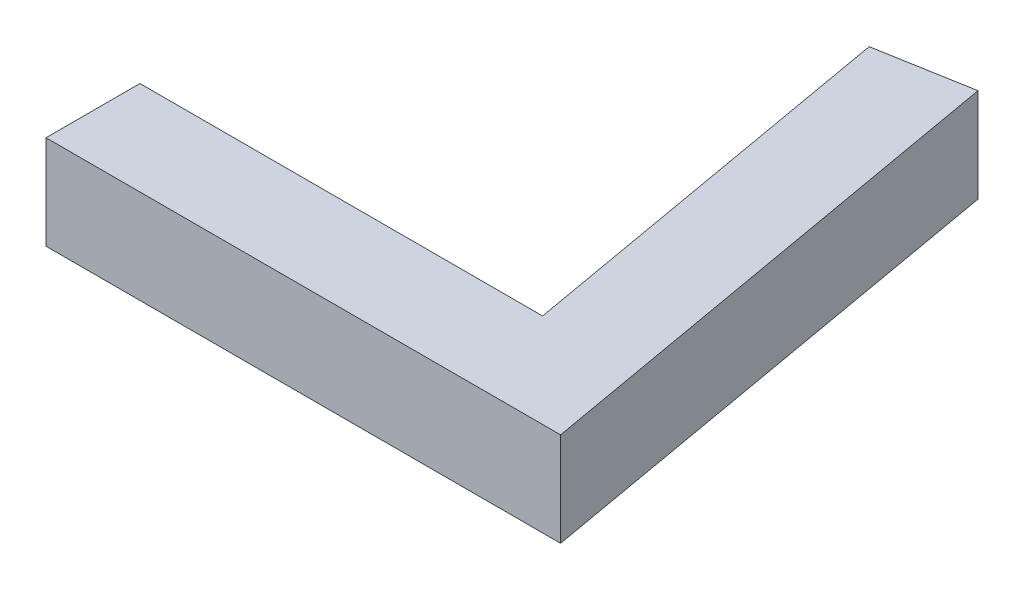
ISO-10303-21;
HEADER;
FILE_DESCRIPTION(('STEP AP214'),'2;1');
FILE_NAME('part.step','',(''),(''),'','','');
FILE_SCHEMA(('AUTOMOTIVE_DESIGN { 1 0 10303 214 1 1 1 1 }'));
ENDSEC;
DATA;
#1=APPLICATION_CONTEXT('core data for automotive mechanical design processes');
#2=APPLICATION_PROTOCOL_DEFINITION('international standard','automotive_design',2000,#1);
#3=PRODUCT_CONTEXT('',#1,'mechanical');
#4=PRODUCT('Part','Part','',(#3));
#5=PRODUCT_RELATED_PRODUCT_CATEGORY('part','',(#4));
#6=PRODUCT_DEFINITION_FORMATION('','',#4);
#7=PRODUCT_DEFINITION_CONTEXT('part definition',#1,'design');
#8=PRODUCT_DEFINITION('design','',#6,#7);
#9=PRODUCT_DEFINITION_SHAPE('','',#8);
#10=(LENGTH_UNIT() NAMED_UNIT(*) SI_UNIT(.MILLI.,.METRE.));
#11=(NAMED_UNIT(*) PLANE_ANGLE_UNIT() SI_UNIT($,.RADIAN.));
#12=(NAMED_UNIT(*) SI_UNIT($,.STERADIAN.) SOLID_ANGLE_UNIT());
#13=UNCERTAINTY_MEASURE_WITH_UNIT(LENGTH_MEASURE(1.E-05),#10,'distance_accuracy_value','');
#14=(GEOMETRIC_REPRESENTATION_CONTEXT(3) GLOBAL_UNCERTAINTY_ASSIGNED_CONTEXT((#13)) GLOBAL_UNIT_ASSIGNED_CONTEXT((#10,
#11,#12)) REPRESENTATION_CONTEXT('',''));
#15=CARTESIAN_POINT('',(0.,0.,0.));
#16=DIRECTION('',(0.,0.,1.));
#17=DIRECTION('',(1.,0.,0.));
#18=AXIS2_PLACEMENT_3D('',#15,#16,#17);
#19=CARTESIAN_POINT('',(3.44682713554273,3.5,-0.607768621834246));
#20=DIRECTION('',(0.984807753012209,0.,-0.173648177666928));
#21=DIRECTION('',(-0.173648177666928,0.,-0.984807753012209));
#22=AXIS2_PLACEMENT_3D('',#19,#20,#21);
#23=PLANE('',#22);
#24=DIRECTION('',(0.173648177666928,0.,0.984807753012209));
#25=VECTOR('',#24,1.);
#26=CARTESIAN_POINT('',(3.44682713554273,0.,-0.607768621834246));
#27=LINE('',#26,#25);
#28=CARTESIAN_POINT('',(0.842104470538816,0.,-15.3798849170174));
#29=VERTEX_POINT('',#28);
#30=CARTESIAN_POINT('',(4.17113757407972,0.,3.5));
#31=VERTEX_POINT('',#30);
#32=EDGE_CURVE('E127',#29,#31,#27,.T.);
#33=ORIENTED_EDGE('',*,*,#32,.F.);
#34=DIRECTION('',(0.,-1.,0.));
#35=VECTOR('',#34,1.);
#36=CARTESIAN_POINT('',(0.842104470538816,3.5,-15.3798849170174));
#37=LINE('',#36,#35);
#38=CARTESIAN_POINT('',(0.842104470538816,3.5,-15.3798849170174));
#39=VERTEX_POINT('',#38);
#40=EDGE_CURVE('E11',#39,#29,#37,.T.);
#41=ORIENTED_EDGE('',*,*,#40,.F.);
#42=DIRECTION('',(0.173648177666928,0.,0.984807753012209));
#43=VECTOR('',#42,1.);
#44=CARTESIAN_POINT('',(3.44682713554273,3.5,-0.607768621834246));
#45=LINE('',#44,#43);
#46=CARTESIAN_POINT('',(4.17113757407972,3.5,3.5));
#47=VERTEX_POINT('',#46);
#48=EDGE_CURVE('E148',#39,#47,#45,.T.);
#49=ORIENTED_EDGE('',*,*,#48,.T.);
#50=DIRECTION('',(0.,-1.,0.));
#51=VECTOR('',#50,1.);
#52=CARTESIAN_POINT('',(4.17113757407972,3.5,3.5));
#53=LINE('',#52,#51);
#54=EDGE_CURVE('E58',#47,#31,#53,.T.);
#55=ORIENTED_EDGE('',*,*,#54,.T.);
#56=EDGE_LOOP('',(#33,#41,#49,#55));
#57=FACE_BOUND('',#56,.T.);
#58=ADVANCED_FACE('F41',(#57),#23,.T.);
#59=CARTESIAN_POINT('',(-2.60472266500391,3.5,-14.7721162951831));
#60=DIRECTION('',(-0.173648177666927,0.,-0.984807753012209));
#61=DIRECTION('',(-0.984807753012209,0.,0.173648177666927));
#62=AXIS2_PLACEMENT_3D('',#59,#60,#61);
#63=PLANE('',#62);
#64=CARTESIAN_POINT('',(-0.881309097232551,1.75,-15.0760006061003));
#65=DIRECTION('',(-0.173648177666928,0.,-0.984807753012209));
#66=DIRECTION('',(-0.984807753012209,0.,0.173648177666928));
#67=AXIS2_PLACEMENT_3D('',#64,#65,#66);
#68=CIRCLE('',#67,0.675);
#69=CARTESIAN_POINT('',(-1.54605433051579,1.75,-14.9587880861751));
#70=VERTEX_POINT('',#69);
#71=EDGE_CURVE('E277',#70,#70,#68,.T.);
#72=ORIENTED_EDGE('',*,*,#71,.F.);
#73=EDGE_LOOP('',(#72));
#74=FACE_BOUND('',#73,.T.);
#75=DIRECTION('',(0.984807753012209,0.,-0.173648177666927));
#76=VECTOR('',#75,1.);
#77=CARTESIAN_POINT('',(-2.60472266500391,0.,-14.7721162951831));
#78=LINE('',#77,#76);
#79=CARTESIAN_POINT('',(-2.60472266500391,0.,-14.7721162951831));
#80=VERTEX_POINT('',#79);
#81=EDGE_CURVE('E130',#80,#29,#78,.T.);
#82=ORIENTED_EDGE('',*,*,#81,.F.);
#83=DIRECTION('',(0.,-1.,0.));
#84=VECTOR('',#83,1.);
#85=CARTESIAN_POINT('',(-2.60472266500391,3.5,-14.7721162951831));
#86=LINE('',#85,#84);
#87=CARTESIAN_POINT('',(-2.60472266500391,3.5,-14.7721162951831));
#88=VERTEX_POINT('',#87);
#89=EDGE_CURVE('E50',#88,#80,#86,.T.);
#90=ORIENTED_EDGE('',*,*,#89,.F.);
#91=DIRECTION('',(0.984807753012209,0.,-0.173648177666927));
#92=VECTOR('',#91,1.);
#93=CARTESIAN_POINT('',(-2.60472266500391,3.5,-14.7721162951831));
#94=LINE('',#93,#92);
#95=EDGE_CURVE('E291',#88,#39,#94,.T.);
#96=ORIENTED_EDGE('',*,*,#95,.T.);
#97=ORIENTED_EDGE('',*,*,#40,.T.);
#98=EDGE_LOOP('',(#82,#90,#96,#97));
#99=FACE_BOUND('',#98,.T.);
#100=ADVANCED_FACE('F161',(#74,#99),#63,.T.);
#101=CARTESIAN_POINT('',(0.,3.5,0.));
#102=DIRECTION('',(-0.984807753012209,0.,0.173648177666928));
#103=DIRECTION('',(0.173648177666928,0.,0.984807753012209));
#104=AXIS2_PLACEMENT_3D('',#101,#102,#103);
#105=PLANE('',#104);
#106=DIRECTION('',(-0.173648177666928,0.,-0.984807753012209));
#107=VECTOR('',#106,1.);
#108=CARTESIAN_POINT('',(0.,0.,0.));
#109=LINE('',#108,#107);
#110=CARTESIAN_POINT('',(0.,0.,0.));
#111=VERTEX_POINT('',#110);
#112=EDGE_CURVE('E135',#111,#80,#109,.T.);
#113=ORIENTED_EDGE('',*,*,#112,.F.);
#114=DIRECTION('',(0.,-1.,0.));
#115=VECTOR('',#114,1.);
#116=CARTESIAN_POINT('',(0.,3.5,0.));
#117=LINE('',#116,#115);
#118=CARTESIAN_POINT('',(0.,3.5,0.));
#119=VERTEX_POINT('',#118);
#120=EDGE_CURVE('E117',#119,#111,#117,.T.);
#121=ORIENTED_EDGE('',*,*,#120,.F.);
#122=DIRECTION('',(-0.173648177666928,0.,-0.984807753012209));
#123=VECTOR('',#122,1.);
#124=CARTESIAN_POINT('',(0.,3.5,0.));
#125=LINE('',#124,#123);
#126=EDGE_CURVE('E105',#119,#88,#125,.T.);
#127=ORIENTED_EDGE('',*,*,#126,.T.);
#128=ORIENTED_EDGE('',*,*,#89,.T.);
#129=EDGE_LOOP('',(#113,#121,#127,#128));
#130=FACE_BOUND('',#129,.T.);
#131=ADVANCED_FACE('F158',(#130),#105,.T.);
#132=CARTESIAN_POINT('',(0.,3.5,0.));
#133=DIRECTION('',(0.,0.,1.));
#134=DIRECTION('',(1.,0.,0.));
#135=AXIS2_PLACEMENT_3D('',#132,#133,#134);
#136=PLANE('',#135);
#137=DIRECTION('',(-1.,0.,0.));
#138=VECTOR('',#137,1.);
#139=CARTESIAN_POINT('',(0.,0.,0.));
#140=LINE('',#139,#138);
#141=CARTESIAN_POINT('',(-15.,0.,0.));
#142=VERTEX_POINT('',#141);
#143=EDGE_CURVE('E113',#111,#142,#140,.T.);
#144=ORIENTED_EDGE('',*,*,#143,.T.);
#145=DIRECTION('',(0.,-1.,0.));
#146=VECTOR('',#145,1.);
#147=CARTESIAN_POINT('',(-15.,3.5,0.));
#148=LINE('',#147,#146);
#149=CARTESIAN_POINT('',(-15.,3.5,0.));
#150=VERTEX_POINT('',#149);
#151=EDGE_CURVE('E110',#150,#142,#148,.T.);
#152=ORIENTED_EDGE('',*,*,#151,.F.);
#153=DIRECTION('',(-1.,0.,0.));
#154=VECTOR('',#153,1.);
#155=CARTESIAN_POINT('',(0.,3.5,0.));
#156=LINE('',#155,#154);
#157=EDGE_CURVE('E97',#119,#150,#156,.T.);
#158=ORIENTED_EDGE('',*,*,#157,.F.);
#159=ORIENTED_EDGE('',*,*,#120,.T.);
#160=EDGE_LOOP('',(#144,#152,#158,#159));
#161=FACE_BOUND('',#160,.T.);
#162=ADVANCED_FACE('F111',(#161),#136,.F.);
#163=CARTESIAN_POINT('',(-15.,3.5,0.));
#164=DIRECTION('',(1.,0.,0.));
#165=DIRECTION('',(0.,0.,-1.));
#166=AXIS2_PLACEMENT_3D('',#163,#164,#165);
#167=PLANE('',#166);
#168=CARTESIAN_POINT('',(-15.,1.75,1.75));
#169=DIRECTION('',(-1.,0.,0.));
#170=DIRECTION('',(0.,0.,1.));
#171=AXIS2_PLACEMENT_3D('',#168,#169,#170);
#172=CIRCLE('',#171,0.675);
#173=CARTESIAN_POINT('',(-15.,1.75,2.425));
#174=VERTEX_POINT('',#173);
#175=EDGE_CURVE('E276',#174,#174,#172,.T.);
#176=ORIENTED_EDGE('',*,*,#175,.F.);
#177=EDGE_LOOP('',(#176));
#178=FACE_BOUND('',#177,.T.);
#179=DIRECTION('',(0.,0.,1.));
#180=VECTOR('',#179,1.);
#181=CARTESIAN_POINT('',(-15.,0.,0.));
#182=LINE('',#181,#180);
#183=CARTESIAN_POINT('',(-15.,0.,3.5));
#184=VERTEX_POINT('',#183);
#185=EDGE_CURVE('E141',#142,#184,#182,.T.);
#186=ORIENTED_EDGE('',*,*,#185,.T.);
#187=DIRECTION('',(0.,-1.,0.));
#188=VECTOR('',#187,1.);
#189=CARTESIAN_POINT('',(-15.,3.5,3.5));
#190=LINE('',#189,#188);
#191=CARTESIAN_POINT('',(-15.,3.5,3.5));
#192=VERTEX_POINT('',#191);
#193=EDGE_CURVE('E78',#192,#184,#190,.T.);
#194=ORIENTED_EDGE('',*,*,#193,.F.);
#195=DIRECTION('',(0.,0.,1.));
#196=VECTOR('',#195,1.);
#197=CARTESIAN_POINT('',(-15.,3.5,0.));
#198=LINE('',#197,#196);
#199=EDGE_CURVE('E102',#150,#192,#198,.T.);
#200=ORIENTED_EDGE('',*,*,#199,.F.);
#201=ORIENTED_EDGE('',*,*,#151,.T.);
#202=EDGE_LOOP('',(#186,#194,#200,#201));
#203=FACE_BOUND('',#202,.T.);
#204=ADVANCED_FACE('F119',(#178,#203),#167,.F.);
#205=CARTESIAN_POINT('',(0.,3.5,3.5));
#206=DIRECTION('',(0.,0.,1.));
#207=DIRECTION('',(1.,0.,0.));
#208=AXIS2_PLACEMENT_3D('',#205,#206,#207);
#209=PLANE('',#208);
#210=DIRECTION('',(-1.,0.,0.));
#211=VECTOR('',#210,1.);
#212=CARTESIAN_POINT('',(0.,0.,3.5));
#213=LINE('',#212,#211);
#214=EDGE_CURVE('E144',#31,#184,#213,.T.);
#215=ORIENTED_EDGE('',*,*,#214,.F.);
#216=ORIENTED_EDGE('',*,*,#54,.F.);
#217=DIRECTION('',(-1.,0.,0.));
#218=VECTOR('',#217,1.);
#219=CARTESIAN_POINT('',(0.,3.5,3.5));
#220=LINE('',#219,#218);
#221=EDGE_CURVE('E121',#47,#192,#220,.T.);
#222=ORIENTED_EDGE('',*,*,#221,.T.);
#223=ORIENTED_EDGE('',*,*,#193,.T.);
#224=EDGE_LOOP('',(#215,#216,#222,#223));
#225=FACE_BOUND('',#224,.T.);
#226=ADVANCED_FACE('F164',(#225),#209,.T.);
#227=CARTESIAN_POINT('',(0.,3.5,0.));
#228=DIRECTION('',(0.,1.,0.));
#229=DIRECTION('',(0.,0.,1.));
#230=AXIS2_PLACEMENT_3D('',#227,#228,#229);
#231=PLANE('',#230);
#232=ORIENTED_EDGE('',*,*,#48,.F.);
#233=ORIENTED_EDGE('',*,*,#95,.F.);
#234=ORIENTED_EDGE('',*,*,#126,.F.);
#235=ORIENTED_EDGE('',*,*,#157,.T.);
#236=ORIENTED_EDGE('',*,*,#199,.T.);
#237=ORIENTED_EDGE('',*,*,#221,.F.);
#238=EDGE_LOOP('',(#232,#233,#234,#235,#236,#237));
#239=FACE_BOUND('',#238,.T.);
#240=ADVANCED_FACE('F99',(#239),#231,.T.);
#241=CARTESIAN_POINT('',(0.,0.,0.));
#242=DIRECTION('',(0.,1.,0.));
#243=DIRECTION('',(0.,0.,1.));
#244=AXIS2_PLACEMENT_3D('',#241,#242,#243);
#245=PLANE('',#244);
#246=ORIENTED_EDGE('',*,*,#32,.T.);
#247=ORIENTED_EDGE('',*,*,#214,.T.);
#248=ORIENTED_EDGE('',*,*,#185,.F.);
#249=ORIENTED_EDGE('',*,*,#143,.F.);
#250=ORIENTED_EDGE('',*,*,#112,.T.);
#251=ORIENTED_EDGE('',*,*,#81,.T.);
#252=EDGE_LOOP('',(#246,#247,#248,#249,#250,#251));
#253=FACE_BOUND('',#252,.T.);
#254=ADVANCED_FACE('F163',(#253),#245,.F.);
#255=CARTESIAN_POINT('',(-5.,1.75,1.75));
#256=DIRECTION('',(-1.,0.,0.));
#257=DIRECTION('',(0.,0.,1.));
#258=AXIS2_PLACEMENT_3D('',#255,#256,#257);
#259=CYLINDRICAL_SURFACE('',#258,0.675);
#260=CARTESIAN_POINT('',(-5.,1.75,1.75));
#261=DIRECTION('',(-1.,0.,0.));
#262=DIRECTION('',(0.,0.,1.));
#263=AXIS2_PLACEMENT_3D('',#260,#261,#262);
#264=CIRCLE('',#263,0.675);
#265=CARTESIAN_POINT('',(-5.,1.75,2.425));
#266=VERTEX_POINT('',#265);
#267=EDGE_CURVE('E131',#266,#266,#264,.T.);
#268=ORIENTED_EDGE('',*,*,#267,.F.);
#269=EDGE_LOOP('',(#268));
#270=FACE_BOUND('',#269,.T.);
#271=ORIENTED_EDGE('',*,*,#175,.T.);
#272=EDGE_LOOP('',(#271));
#273=FACE_BOUND('',#272,.T.);
#274=ADVANCED_FACE('F206',(#270,#273),#259,.F.);
#275=CARTESIAN_POINT('',(-5.,0.,0.));
#276=DIRECTION('',(-1.,0.,0.));
#277=DIRECTION('',(0.,0.,1.));
#278=AXIS2_PLACEMENT_3D('',#275,#276,#277);
#279=PLANE('',#278);
#280=ORIENTED_EDGE('',*,*,#267,.T.);
#281=EDGE_LOOP('',(#280));
#282=FACE_BOUND('',#281,.T.);
#283=ADVANCED_FACE('F211',(#282),#279,.T.);
#284=CARTESIAN_POINT('',(0.855172679436732,1.75,-5.22792307597818));
#285=DIRECTION('',(-0.173648177666928,0.,-0.984807753012209));
#286=DIRECTION('',(-0.984807753012209,0.,0.173648177666928));
#287=AXIS2_PLACEMENT_3D('',#284,#285,#286);
#288=CYLINDRICAL_SURFACE('',#287,0.675);
#289=CARTESIAN_POINT('',(0.855172679436732,1.75,-5.22792307597818));
#290=DIRECTION('',(-0.173648177666928,0.,-0.984807753012209));
#291=DIRECTION('',(-0.984807753012209,0.,0.173648177666928));
#292=AXIS2_PLACEMENT_3D('',#289,#290,#291);
#293=CIRCLE('',#292,0.675);
#294=CARTESIAN_POINT('',(0.190427446153491,1.75,-5.110710556053));
#295=VERTEX_POINT('',#294);
#296=EDGE_CURVE('E274',#295,#295,#293,.T.);
#297=ORIENTED_EDGE('',*,*,#296,.F.);
#298=EDGE_LOOP('',(#297));
#299=FACE_BOUND('',#298,.T.);
#300=ORIENTED_EDGE('',*,*,#71,.T.);
#301=EDGE_LOOP('',(#300));
#302=FACE_BOUND('',#301,.T.);
#303=ADVANCED_FACE('F221',(#299,#302),#288,.F.);
#304=CARTESIAN_POINT('',(-0.86824088833464,0.,-4.92403876506105));
#305=DIRECTION('',(-0.173648177666928,0.,-0.984807753012209));
#306=DIRECTION('',(-0.984807753012209,0.,0.173648177666928));
#307=AXIS2_PLACEMENT_3D('',#304,#305,#306);
#308=PLANE('',#307);
#309=ORIENTED_EDGE('',*,*,#296,.T.);
#310=EDGE_LOOP('',(#309));
#311=FACE_BOUND('',#310,.T.);
#312=ADVANCED_FACE('F238',(#311),#308,.T.);
#313=CLOSED_SHELL('',(#58,#100,#131,#162,#204,#226,#240,#254,#274,#283,#303,#312));
#314=MANIFOLD_SOLID_BREP('B2',#313);
#315=ADVANCED_BREP_SHAPE_REPRESENTATION('',(#18,#314),#14);
#316=SHAPE_DEFINITION_REPRESENTATION(#9,#315);
ENDSEC;
END-ISO-10303-21;
